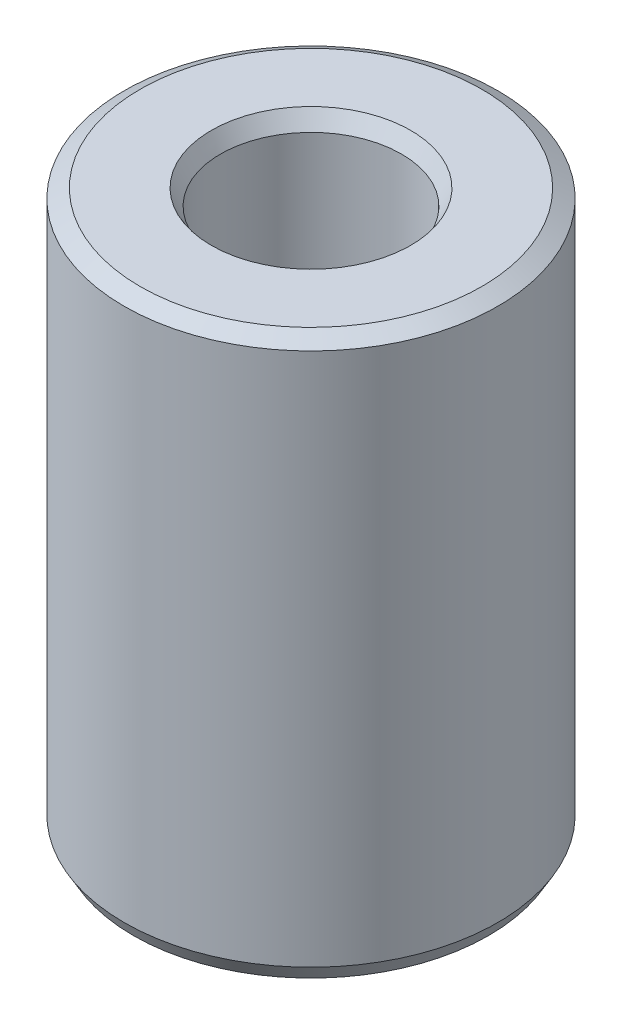
ISO-10303-21;
HEADER;
FILE_DESCRIPTION(('STEP AP214'),'2;1');
FILE_NAME('part.step','',(''),(''),'','','');
FILE_SCHEMA(('AUTOMOTIVE_DESIGN { 1 0 10303 214 1 1 1 1 }'));
ENDSEC;
DATA;
#1=APPLICATION_CONTEXT('core data for automotive mechanical design processes');
#2=APPLICATION_PROTOCOL_DEFINITION('international standard','automotive_design',2000,#1);
#3=PRODUCT_CONTEXT('',#1,'mechanical');
#4=PRODUCT('Part','Part','',(#3));
#5=PRODUCT_RELATED_PRODUCT_CATEGORY('part','',(#4));
#6=PRODUCT_DEFINITION_FORMATION('','',#4);
#7=PRODUCT_DEFINITION_CONTEXT('part definition',#1,'design');
#8=PRODUCT_DEFINITION('design','',#6,#7);
#9=PRODUCT_DEFINITION_SHAPE('','',#8);
#10=(LENGTH_UNIT() NAMED_UNIT(*) SI_UNIT(.MILLI.,.METRE.));
#11=(NAMED_UNIT(*) PLANE_ANGLE_UNIT() SI_UNIT($,.RADIAN.));
#12=(NAMED_UNIT(*) SI_UNIT($,.STERADIAN.) SOLID_ANGLE_UNIT());
#13=UNCERTAINTY_MEASURE_WITH_UNIT(LENGTH_MEASURE(1.E-05),#10,'distance_accuracy_value','');
#14=(GEOMETRIC_REPRESENTATION_CONTEXT(3) GLOBAL_UNCERTAINTY_ASSIGNED_CONTEXT((#13)) GLOBAL_UNIT_ASSIGNED_CONTEXT((#10,
#11,#12)) REPRESENTATION_CONTEXT('',''));
#15=CARTESIAN_POINT('',(0.,0.,0.));
#16=DIRECTION('',(0.,0.,1.));
#17=DIRECTION('',(1.,0.,0.));
#18=AXIS2_PLACEMENT_3D('',#15,#16,#17);
#19=CARTESIAN_POINT('',(0.,22.4370577544893,0.));
#20=DIRECTION('',(0.,-1.,0.));
#21=DIRECTION('',(0.,0.,-1.));
#22=AXIS2_PLACEMENT_3D('',#19,#20,#21);
#23=CYLINDRICAL_SURFACE('',#22,7.5);
#24=CARTESIAN_POINT('',(0.,0.638674389834927,0.));
#25=DIRECTION('',(0.,1.,0.));
#26=DIRECTION('',(0.,0.,1.));
#27=AXIS2_PLACEMENT_3D('',#24,#25,#26);
#28=CIRCLE('',#27,7.5);
#29=CARTESIAN_POINT('',(0.,0.638674389834927,7.5));
#30=VERTEX_POINT('',#29);
#31=EDGE_CURVE('E10',#30,#30,#28,.T.);
#32=ORIENTED_EDGE('',*,*,#31,.T.);
#33=EDGE_LOOP('',(#32));
#34=FACE_BOUND('',#33,.T.);
#35=CARTESIAN_POINT('',(0.,22.0683189235936,0.));
#36=DIRECTION('',(0.,1.,0.));
#37=DIRECTION('',(0.,0.,1.));
#38=AXIS2_PLACEMENT_3D('',#35,#36,#37);
#39=CIRCLE('',#38,7.5);
#40=CARTESIAN_POINT('',(0.,22.0683189235936,7.5));
#41=VERTEX_POINT('',#40);
#42=EDGE_CURVE('E50',#41,#41,#39,.F.);
#43=ORIENTED_EDGE('',*,*,#42,.T.);
#44=EDGE_LOOP('',(#43));
#45=FACE_BOUND('',#44,.T.);
#46=ADVANCED_FACE('F39',(#34,#45),#23,.T.);
#47=CARTESIAN_POINT('',(0.,22.4370577544893,0.));
#48=DIRECTION('',(0.,1.,0.));
#49=DIRECTION('',(0.,0.,1.));
#50=AXIS2_PLACEMENT_3D('',#47,#48,#49);
#51=PLANE('',#50);
#52=CARTESIAN_POINT('',(0.,22.4370577544893,0.));
#53=DIRECTION('',(0.,1.,0.));
#54=DIRECTION('',(0.,0.,1.));
#55=AXIS2_PLACEMENT_3D('',#52,#53,#54);
#56=CIRCLE('',#55,4.0025937420088);
#57=CARTESIAN_POINT('',(0.,22.4370577544893,4.0025937420088));
#58=VERTEX_POINT('',#57);
#59=EDGE_CURVE('E58',#58,#58,#56,.F.);
#60=ORIENTED_EDGE('',*,*,#59,.T.);
#61=EDGE_LOOP('',(#60));
#62=FACE_BOUND('',#61,.T.);
#63=CARTESIAN_POINT('',(0.,22.4370577544893,0.));
#64=DIRECTION('',(0.,1.,0.));
#65=DIRECTION('',(0.,0.,1.));
#66=AXIS2_PLACEMENT_3D('',#63,#64,#65);
#67=CIRCLE('',#66,6.86132561016507);
#68=CARTESIAN_POINT('',(0.,22.4370577544893,6.86132561016507));
#69=VERTEX_POINT('',#68);
#70=EDGE_CURVE('E61',#69,#69,#67,.T.);
#71=ORIENTED_EDGE('',*,*,#70,.T.);
#72=EDGE_LOOP('',(#71));
#73=FACE_BOUND('',#72,.T.);
#74=ADVANCED_FACE('F88',(#62,#73),#51,.T.);
#75=CARTESIAN_POINT('',(0.,0.,0.));
#76=DIRECTION('',(0.,1.,0.));
#77=DIRECTION('',(0.,0.,1.));
#78=AXIS2_PLACEMENT_3D('',#75,#76,#77);
#79=PLANE('',#78);
#80=CARTESIAN_POINT('',(0.,0.,0.));
#81=DIRECTION('',(0.,1.,0.));
#82=DIRECTION('',(0.,0.,1.));
#83=AXIS2_PLACEMENT_3D('',#80,#81,#82);
#84=CIRCLE('',#83,4.27252930094801);
#85=CARTESIAN_POINT('',(0.,0.,4.27252930094801));
#86=VERTEX_POINT('',#85);
#87=EDGE_CURVE('E51',#86,#86,#84,.T.);
#88=ORIENTED_EDGE('',*,*,#87,.T.);
#89=EDGE_LOOP('',(#88));
#90=FACE_BOUND('',#89,.T.);
#91=CARTESIAN_POINT('',(0.,0.,0.));
#92=DIRECTION('',(0.,1.,0.));
#93=DIRECTION('',(0.,0.,1.));
#94=AXIS2_PLACEMENT_3D('',#91,#92,#93);
#95=CIRCLE('',#94,7.13126116910428);
#96=CARTESIAN_POINT('',(0.,0.,7.13126116910428));
#97=VERTEX_POINT('',#96);
#98=EDGE_CURVE('E54',#97,#97,#95,.F.);
#99=ORIENTED_EDGE('',*,*,#98,.T.);
#100=EDGE_LOOP('',(#99));
#101=FACE_BOUND('',#100,.T.);
#102=ADVANCED_FACE('F83',(#90,#101),#79,.F.);
#103=CARTESIAN_POINT('',(0.,22.4370577544893,0.));
#104=DIRECTION('',(0.,-1.,0.));
#105=DIRECTION('',(0.,0.,-1.));
#106=AXIS2_PLACEMENT_3D('',#103,#104,#105);
#107=CYLINDRICAL_SURFACE('',#106,3.63385491111308);
#108=CARTESIAN_POINT('',(0.,21.7983833646544,0.));
#109=DIRECTION('',(0.,1.,0.));
#110=DIRECTION('',(0.,0.,1.));
#111=AXIS2_PLACEMENT_3D('',#108,#109,#110);
#112=CIRCLE('',#111,3.63385491111308);
#113=CARTESIAN_POINT('',(0.,21.7983833646544,3.63385491111308));
#114=VERTEX_POINT('',#113);
#115=EDGE_CURVE('E67',#114,#114,#112,.T.);
#116=ORIENTED_EDGE('',*,*,#115,.T.);
#117=EDGE_LOOP('',(#116));
#118=FACE_BOUND('',#117,.T.);
#119=CARTESIAN_POINT('',(0.,0.368738830895717,0.));
#120=DIRECTION('',(0.,1.,0.));
#121=DIRECTION('',(0.,0.,1.));
#122=AXIS2_PLACEMENT_3D('',#119,#120,#121);
#123=CIRCLE('',#122,3.63385491111308);
#124=CARTESIAN_POINT('',(0.,0.368738830895717,3.63385491111308));
#125=VERTEX_POINT('',#124);
#126=EDGE_CURVE('E69',#125,#125,#123,.F.);
#127=ORIENTED_EDGE('',*,*,#126,.T.);
#128=EDGE_LOOP('',(#127));
#129=FACE_BOUND('',#128,.T.);
#130=ADVANCED_FACE('F71',(#118,#129),#107,.F.);
#131=CARTESIAN_POINT('',(0.,21.7983833646544,0.));
#132=DIRECTION('',(0.,1.,0.));
#133=DIRECTION('',(0.,0.,1.));
#134=AXIS2_PLACEMENT_3D('',#131,#132,#133);
#135=CONICAL_SURFACE('',#134,3.63385491111308,0.523598775598296);
#136=ORIENTED_EDGE('',*,*,#59,.F.);
#137=EDGE_LOOP('',(#136));
#138=FACE_BOUND('',#137,.T.);
#139=ORIENTED_EDGE('',*,*,#115,.F.);
#140=EDGE_LOOP('',(#139));
#141=FACE_BOUND('',#140,.T.);
#142=ADVANCED_FACE('F77',(#138,#141),#135,.F.);
#143=CARTESIAN_POINT('',(0.,0.,0.));
#144=DIRECTION('',(0.,-1.,0.));
#145=DIRECTION('',(0.,0.,-1.));
#146=AXIS2_PLACEMENT_3D('',#143,#144,#145);
#147=CONICAL_SURFACE('',#146,4.27252930094801,1.0471975511966);
#148=ORIENTED_EDGE('',*,*,#126,.F.);
#149=EDGE_LOOP('',(#148));
#150=FACE_BOUND('',#149,.T.);
#151=ORIENTED_EDGE('',*,*,#87,.F.);
#152=EDGE_LOOP('',(#151));
#153=FACE_BOUND('',#152,.T.);
#154=ADVANCED_FACE('F73',(#150,#153),#147,.F.);
#155=CARTESIAN_POINT('',(0.,0.638674389834927,0.));
#156=DIRECTION('',(0.,1.,0.));
#157=DIRECTION('',(0.,0.,1.));
#158=AXIS2_PLACEMENT_3D('',#155,#156,#157);
#159=CONICAL_SURFACE('',#158,7.5,0.523598775598303);
#160=ORIENTED_EDGE('',*,*,#98,.F.);
#161=EDGE_LOOP('',(#160));
#162=FACE_BOUND('',#161,.T.);
#163=ORIENTED_EDGE('',*,*,#31,.F.);
#164=EDGE_LOOP('',(#163));
#165=FACE_BOUND('',#164,.T.);
#166=ADVANCED_FACE('F76',(#162,#165),#159,.T.);
#167=CARTESIAN_POINT('',(0.,22.4370577544893,0.));
#168=DIRECTION('',(0.,-1.,0.));
#169=DIRECTION('',(0.,0.,-1.));
#170=AXIS2_PLACEMENT_3D('',#167,#168,#169);
#171=CONICAL_SURFACE('',#170,6.86132561016507,1.04719755119659);
#172=ORIENTED_EDGE('',*,*,#42,.F.);
#173=EDGE_LOOP('',(#172));
#174=FACE_BOUND('',#173,.T.);
#175=ORIENTED_EDGE('',*,*,#70,.F.);
#176=EDGE_LOOP('',(#175));
#177=FACE_BOUND('',#176,.T.);
#178=ADVANCED_FACE('F45',(#174,#177),#171,.T.);
#179=CLOSED_SHELL('',(#46,#74,#102,#130,#142,#154,#166,#178));
#180=MANIFOLD_SOLID_BREP('B2',#179);
#181=ADVANCED_BREP_SHAPE_REPRESENTATION('',(#18,#180),#14);
#182=SHAPE_DEFINITION_REPRESENTATION(#9,#181);
ENDSEC;
END-ISO-10303-21;
